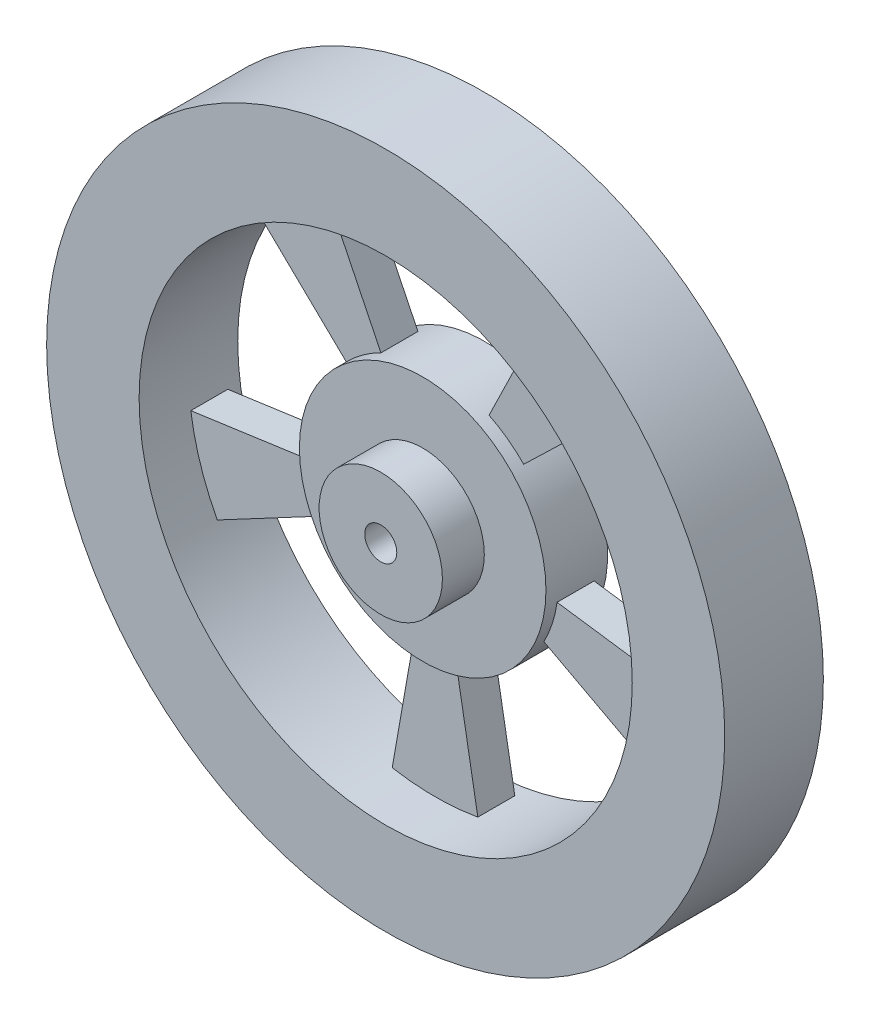
ISO-10303-21;
HEADER;
FILE_DESCRIPTION(('STEP AP214'),'2;1');
FILE_NAME('part.step','',(''),(''),'','','');
FILE_SCHEMA(('AUTOMOTIVE_DESIGN { 1 0 10303 214 1 1 1 1 }'));
ENDSEC;
DATA;
#1=APPLICATION_CONTEXT('core data for automotive mechanical design processes');
#2=APPLICATION_PROTOCOL_DEFINITION('international standard','automotive_design',2000,#1);
#3=PRODUCT_CONTEXT('',#1,'mechanical');
#4=PRODUCT('Part','Part','',(#3));
#5=PRODUCT_RELATED_PRODUCT_CATEGORY('part','',(#4));
#6=PRODUCT_DEFINITION_FORMATION('','',#4);
#7=PRODUCT_DEFINITION_CONTEXT('part definition',#1,'design');
#8=PRODUCT_DEFINITION('design','',#6,#7);
#9=PRODUCT_DEFINITION_SHAPE('','',#8);
#10=(LENGTH_UNIT() NAMED_UNIT(*) SI_UNIT(.MILLI.,.METRE.));
#11=(NAMED_UNIT(*) PLANE_ANGLE_UNIT() SI_UNIT($,.RADIAN.));
#12=(NAMED_UNIT(*) SI_UNIT($,.STERADIAN.) SOLID_ANGLE_UNIT());
#13=UNCERTAINTY_MEASURE_WITH_UNIT(LENGTH_MEASURE(1.E-05),#10,'distance_accuracy_value','');
#14=(GEOMETRIC_REPRESENTATION_CONTEXT(3) GLOBAL_UNCERTAINTY_ASSIGNED_CONTEXT((#13)) GLOBAL_UNIT_ASSIGNED_CONTEXT((#10,
#11,#12)) REPRESENTATION_CONTEXT('',''));
#15=CARTESIAN_POINT('',(0.,0.,0.));
#16=DIRECTION('',(0.,0.,1.));
#17=DIRECTION('',(1.,0.,0.));
#18=AXIS2_PLACEMENT_3D('',#15,#16,#17);
#19=CARTESIAN_POINT('',(0.,0.,5.08));
#20=DIRECTION('',(0.,0.,-1.));
#21=DIRECTION('',(-1.,0.,0.));
#22=AXIS2_PLACEMENT_3D('',#19,#20,#21);
#23=CYLINDRICAL_SURFACE('',#22,6.35);
#24=CARTESIAN_POINT('',(0.,0.,0.635));
#25=DIRECTION('',(0.,0.,-1.));
#26=DIRECTION('',(-1.,0.,0.));
#27=AXIS2_PLACEMENT_3D('',#24,#25,#26);
#28=CIRCLE('',#27,6.35);
#29=CARTESIAN_POINT('',(-4.56780773215048,4.41108065241459,0.635));
#30=VERTEX_POINT('',#29);
#31=CARTESIAN_POINT('',(-2.78365678211073,5.70734219399967,0.635));
#32=VERTEX_POINT('',#31);
#33=EDGE_CURVE('E170',#30,#32,#28,.T.);
#34=ORIENTED_EDGE('',*,*,#33,.T.);
#35=DIRECTION('',(0.,0.,-1.));
#36=VECTOR('',#35,1.);
#37=CARTESIAN_POINT('',(-2.78365678211073,5.70734219399967,5.08));
#38=LINE('',#37,#36);
#39=CARTESIAN_POINT('',(-2.78365678211073,5.70734219399967,2.54));
#40=VERTEX_POINT('',#39);
#41=EDGE_CURVE('E198',#40,#32,#38,.T.);
#42=ORIENTED_EDGE('',*,*,#41,.F.);
#43=CARTESIAN_POINT('',(0.,0.,2.54));
#44=DIRECTION('',(0.,0.,1.));
#45=DIRECTION('',(1.,0.,0.));
#46=AXIS2_PLACEMENT_3D('',#43,#44,#45);
#47=CIRCLE('',#46,6.35);
#48=CARTESIAN_POINT('',(-4.56780773215047,4.41108065241459,2.54));
#49=VERTEX_POINT('',#48);
#50=EDGE_CURVE('E196',#40,#49,#47,.T.);
#51=ORIENTED_EDGE('',*,*,#50,.T.);
#52=DIRECTION('',(0.,0.,-1.));
#53=VECTOR('',#52,1.);
#54=CARTESIAN_POINT('',(-4.56780773215047,4.41108065241459,5.08));
#55=LINE('',#54,#53);
#56=EDGE_CURVE('E190',#49,#30,#55,.T.);
#57=ORIENTED_EDGE('',*,*,#56,.T.);
#58=EDGE_LOOP('',(#34,#42,#51,#57));
#59=FACE_BOUND('',#58,.T.);
#60=CARTESIAN_POINT('',(2.78365678211061,5.70734219399973,0.635));
#61=VERTEX_POINT('',#60);
#62=CARTESIAN_POINT('',(4.56780773215038,4.41108065241469,0.635));
#63=VERTEX_POINT('',#62);
#64=EDGE_CURVE('E182',#61,#63,#28,.T.);
#65=ORIENTED_EDGE('',*,*,#64,.T.);
#66=DIRECTION('',(0.,0.,-1.));
#67=VECTOR('',#66,1.);
#68=CARTESIAN_POINT('',(4.56780773215038,4.41108065241469,5.08));
#69=LINE('',#68,#67);
#70=CARTESIAN_POINT('',(4.56780773215038,4.41108065241469,2.54));
#71=VERTEX_POINT('',#70);
#72=EDGE_CURVE('E216',#71,#63,#69,.T.);
#73=ORIENTED_EDGE('',*,*,#72,.F.);
#74=CARTESIAN_POINT('',(2.78365678211061,5.70734219399973,2.54));
#75=VERTEX_POINT('',#74);
#76=EDGE_CURVE('E617',#71,#75,#47,.T.);
#77=ORIENTED_EDGE('',*,*,#76,.T.);
#78=DIRECTION('',(0.,0.,-1.));
#79=VECTOR('',#78,1.);
#80=CARTESIAN_POINT('',(2.78365678211061,5.70734219399973,5.08));
#81=LINE('',#80,#79);
#82=EDGE_CURVE('E213',#75,#61,#81,.T.);
#83=ORIENTED_EDGE('',*,*,#82,.T.);
#84=EDGE_LOOP('',(#65,#73,#77,#83));
#85=FACE_BOUND('',#84,.T.);
#86=CARTESIAN_POINT('',(6.28820223650898,-0.883749191096396,0.635));
#87=VERTEX_POINT('',#86);
#88=CARTESIAN_POINT('',(5.60671721465422,-2.98114442369036,0.635));
#89=VERTEX_POINT('',#88);
#90=EDGE_CURVE('E679',#87,#89,#28,.T.);
#91=ORIENTED_EDGE('',*,*,#90,.T.);
#92=DIRECTION('',(0.,0.,-1.));
#93=VECTOR('',#92,1.);
#94=CARTESIAN_POINT('',(5.60671721465422,-2.98114442369036,5.08));
#95=LINE('',#94,#93);
#96=CARTESIAN_POINT('',(5.60671721465422,-2.98114442369036,2.54));
#97=VERTEX_POINT('',#96);
#98=EDGE_CURVE('E224',#97,#89,#95,.T.);
#99=ORIENTED_EDGE('',*,*,#98,.F.);
#100=CARTESIAN_POINT('',(6.28820223650898,-0.883749191096397,2.54));
#101=VERTEX_POINT('',#100);
#102=EDGE_CURVE('E56',#97,#101,#47,.T.);
#103=ORIENTED_EDGE('',*,*,#102,.T.);
#104=DIRECTION('',(0.,0.,-1.));
#105=VECTOR('',#104,1.);
#106=CARTESIAN_POINT('',(6.28820223650898,-0.883749191096397,5.08));
#107=LINE('',#106,#105);
#108=EDGE_CURVE('E222',#101,#87,#107,.T.);
#109=ORIENTED_EDGE('',*,*,#108,.T.);
#110=EDGE_LOOP('',(#91,#99,#103,#109));
#111=FACE_BOUND('',#110,.T.);
#112=DIRECTION('',(0.,0.,-1.));
#113=VECTOR('',#112,1.);
#114=CARTESIAN_POINT('',(-5.60671721465415,-2.98114442369047,5.08));
#115=LINE('',#114,#113);
#116=CARTESIAN_POINT('',(-5.60671721465415,-2.98114442369047,2.54));
#117=VERTEX_POINT('',#116);
#118=CARTESIAN_POINT('',(-5.60671721465415,-2.98114442369047,0.635));
#119=VERTEX_POINT('',#118);
#120=EDGE_CURVE('E260',#117,#119,#115,.T.);
#121=ORIENTED_EDGE('',*,*,#120,.T.);
#122=CARTESIAN_POINT('',(-6.28820223650896,-0.883749191096527,0.635));
#123=VERTEX_POINT('',#122);
#124=EDGE_CURVE('E184',#119,#123,#28,.T.);
#125=ORIENTED_EDGE('',*,*,#124,.T.);
#126=DIRECTION('',(0.,0.,-1.));
#127=VECTOR('',#126,1.);
#128=CARTESIAN_POINT('',(-6.28820223650896,-0.883749191096527,5.08));
#129=LINE('',#128,#127);
#130=CARTESIAN_POINT('',(-6.28820223650896,-0.883749191096527,2.54));
#131=VERTEX_POINT('',#130);
#132=EDGE_CURVE('E210',#131,#123,#129,.T.);
#133=ORIENTED_EDGE('',*,*,#132,.F.);
#134=EDGE_CURVE('E672',#131,#117,#47,.T.);
#135=ORIENTED_EDGE('',*,*,#134,.T.);
#136=EDGE_LOOP('',(#121,#125,#133,#135));
#137=FACE_BOUND('',#136,.T.);
#138=CARTESIAN_POINT('',(1.10266592818501,-6.25352923162752,0.635));
#139=VERTEX_POINT('',#138);
#140=CARTESIAN_POINT('',(-1.10266592818497,-6.25352923162753,0.635));
#141=VERTEX_POINT('',#140);
#142=EDGE_CURVE('E678',#139,#141,#28,.T.);
#143=ORIENTED_EDGE('',*,*,#142,.T.);
#144=DIRECTION('',(0.,0.,-1.));
#145=VECTOR('',#144,1.);
#146=CARTESIAN_POINT('',(-1.10266592818497,-6.25352923162753,5.08));
#147=LINE('',#146,#145);
#148=CARTESIAN_POINT('',(-1.10266592818497,-6.25352923162753,2.54));
#149=VERTEX_POINT('',#148);
#150=EDGE_CURVE('E257',#149,#141,#147,.T.);
#151=ORIENTED_EDGE('',*,*,#150,.F.);
#152=CARTESIAN_POINT('',(1.10266592818501,-6.25352923162752,2.54));
#153=VERTEX_POINT('',#152);
#154=EDGE_CURVE('E48',#149,#153,#47,.T.);
#155=ORIENTED_EDGE('',*,*,#154,.T.);
#156=DIRECTION('',(0.,0.,-1.));
#157=VECTOR('',#156,1.);
#158=CARTESIAN_POINT('',(1.10266592818501,-6.25352923162752,5.08));
#159=LINE('',#158,#157);
#160=EDGE_CURVE('E233',#153,#139,#159,.T.);
#161=ORIENTED_EDGE('',*,*,#160,.T.);
#162=EDGE_LOOP('',(#143,#151,#155,#161));
#163=FACE_BOUND('',#162,.T.);
#164=CARTESIAN_POINT('',(0.,0.,0.));
#165=DIRECTION('',(0.,0.,1.));
#166=DIRECTION('',(-1.,0.,0.));
#167=AXIS2_PLACEMENT_3D('',#164,#165,#166);
#168=CIRCLE('',#167,6.35);
#169=CARTESIAN_POINT('',(-6.35,0.,0.));
#170=VERTEX_POINT('',#169);
#171=EDGE_CURVE('E248',#170,#170,#168,.T.);
#172=ORIENTED_EDGE('',*,*,#171,.T.);
#173=EDGE_LOOP('',(#172));
#174=FACE_BOUND('',#173,.T.);
#175=CARTESIAN_POINT('',(0.,0.,3.175));
#176=DIRECTION('',(0.,0.,1.));
#177=DIRECTION('',(1.,0.,0.));
#178=AXIS2_PLACEMENT_3D('',#175,#176,#177);
#179=CIRCLE('',#178,6.35);
#180=CARTESIAN_POINT('',(6.35,0.,3.175));
#181=VERTEX_POINT('',#180);
#182=EDGE_CURVE('E650',#181,#181,#179,.T.);
#183=ORIENTED_EDGE('',*,*,#182,.F.);
#184=EDGE_LOOP('',(#183));
#185=FACE_BOUND('',#184,.T.);
#186=ADVANCED_FACE('F33',(#59,#85,#111,#137,#163,#174,#185),#23,.T.);
#187=CARTESIAN_POINT('',(-2.20533185636994,-12.5070584632551,5.08));
#188=DIRECTION('',(0.984807753012209,-0.173648177666924,0.));
#189=DIRECTION('',(0.173648177666924,0.984807753012209,0.));
#190=AXIS2_PLACEMENT_3D('',#187,#188,#189);
#191=PLANE('',#190);
#192=DIRECTION('',(0.173648177666924,0.984807753012209,0.));
#193=VECTOR('',#192,1.);
#194=CARTESIAN_POINT('',(-2.20533185636994,-12.5070584632551,0.635));
#195=LINE('',#194,#193);
#196=CARTESIAN_POINT('',(-2.20533185636994,-12.5070584632551,0.635));
#197=VERTEX_POINT('',#196);
#198=EDGE_CURVE('E669',#197,#141,#195,.T.);
#199=ORIENTED_EDGE('',*,*,#198,.F.);
#200=DIRECTION('',(0.,0.,-1.));
#201=VECTOR('',#200,1.);
#202=CARTESIAN_POINT('',(-2.20533185636994,-12.5070584632551,5.08));
#203=LINE('',#202,#201);
#204=CARTESIAN_POINT('',(-2.20533185636994,-12.5070584632551,2.54));
#205=VERTEX_POINT('',#204);
#206=EDGE_CURVE('E253',#205,#197,#203,.T.);
#207=ORIENTED_EDGE('',*,*,#206,.F.);
#208=DIRECTION('',(-0.173648177666924,-0.984807753012209,0.));
#209=VECTOR('',#208,1.);
#210=CARTESIAN_POINT('',(-2.20533185636994,-12.5070584632551,2.54));
#211=LINE('',#210,#209);
#212=EDGE_CURVE('E635',#149,#205,#211,.T.);
#213=ORIENTED_EDGE('',*,*,#212,.F.);
#214=ORIENTED_EDGE('',*,*,#150,.T.);
#215=EDGE_LOOP('',(#199,#207,#213,#214));
#216=FACE_BOUND('',#215,.T.);
#217=ADVANCED_FACE('F290',(#216),#191,.F.);
#218=CARTESIAN_POINT('',(-5.60671721465415,-2.98114442369047,5.08));
#219=DIRECTION('',(-0.469471562785901,0.882947592858921,0.));
#220=DIRECTION('',(-0.882947592858922,-0.469471562785901,0.));
#221=AXIS2_PLACEMENT_3D('',#218,#219,#220);
#222=PLANE('',#221);
#223=DIRECTION('',(-0.882947592858922,-0.469471562785901,0.));
#224=VECTOR('',#223,1.);
#225=CARTESIAN_POINT('',(-5.60671721465415,-2.98114442369047,0.635));
#226=LINE('',#225,#224);
#227=CARTESIAN_POINT('',(-11.2134344293083,-5.96228884738094,0.635));
#228=VERTEX_POINT('',#227);
#229=EDGE_CURVE('E668',#119,#228,#226,.T.);
#230=ORIENTED_EDGE('',*,*,#229,.F.);
#231=ORIENTED_EDGE('',*,*,#120,.F.);
#232=DIRECTION('',(0.882947592858922,0.469471562785901,0.));
#233=VECTOR('',#232,1.);
#234=CARTESIAN_POINT('',(-5.60671721465415,-2.98114442369047,2.54));
#235=LINE('',#234,#233);
#236=CARTESIAN_POINT('',(-11.2134344293083,-5.96228884738094,2.54));
#237=VERTEX_POINT('',#236);
#238=EDGE_CURVE('E633',#237,#117,#235,.T.);
#239=ORIENTED_EDGE('',*,*,#238,.F.);
#240=DIRECTION('',(0.,0.,-1.));
#241=VECTOR('',#240,1.);
#242=CARTESIAN_POINT('',(-11.2134344293083,-5.96228884738094,5.08));
#243=LINE('',#242,#241);
#244=EDGE_CURVE('E247',#237,#228,#243,.T.);
#245=ORIENTED_EDGE('',*,*,#244,.T.);
#246=EDGE_LOOP('',(#230,#231,#239,#245));
#247=FACE_BOUND('',#246,.T.);
#248=ADVANCED_FACE('F295',(#247),#222,.F.);
#249=CARTESIAN_POINT('',(1.10266592818501,-6.25352923162752,5.08));
#250=DIRECTION('',(-0.984807753012208,-0.173648177666931,0.));
#251=DIRECTION('',(0.173648177666931,-0.984807753012208,0.));
#252=AXIS2_PLACEMENT_3D('',#249,#250,#251);
#253=PLANE('',#252);
#254=DIRECTION('',(0.173648177666931,-0.984807753012208,0.));
#255=VECTOR('',#254,1.);
#256=CARTESIAN_POINT('',(1.10266592818501,-6.25352923162752,0.635));
#257=LINE('',#256,#255);
#258=CARTESIAN_POINT('',(2.20533185637002,-12.507058463255,0.635));
#259=VERTEX_POINT('',#258);
#260=EDGE_CURVE('E666',#139,#259,#257,.T.);
#261=ORIENTED_EDGE('',*,*,#260,.F.);
#262=ORIENTED_EDGE('',*,*,#160,.F.);
#263=DIRECTION('',(-0.173648177666931,0.984807753012208,0.));
#264=VECTOR('',#263,1.);
#265=CARTESIAN_POINT('',(1.10266592818501,-6.25352923162752,2.54));
#266=LINE('',#265,#264);
#267=CARTESIAN_POINT('',(2.20533185637002,-12.507058463255,2.54));
#268=VERTEX_POINT('',#267);
#269=EDGE_CURVE('E631',#268,#153,#266,.T.);
#270=ORIENTED_EDGE('',*,*,#269,.F.);
#271=DIRECTION('',(0.,0.,-1.));
#272=VECTOR('',#271,1.);
#273=CARTESIAN_POINT('',(2.20533185637002,-12.507058463255,5.08));
#274=LINE('',#273,#272);
#275=EDGE_CURVE('E236',#268,#259,#274,.T.);
#276=ORIENTED_EDGE('',*,*,#275,.T.);
#277=EDGE_LOOP('',(#261,#262,#270,#276));
#278=FACE_BOUND('',#277,.T.);
#279=ADVANCED_FACE('F301',(#278),#253,.F.);
#280=CARTESIAN_POINT('',(11.2134344293084,-5.96228884738071,5.08));
#281=DIRECTION('',(0.469471562785883,0.882947592858931,0.));
#282=DIRECTION('',(-0.882947592858931,0.469471562785883,0.));
#283=AXIS2_PLACEMENT_3D('',#280,#281,#282);
#284=PLANE('',#283);
#285=DIRECTION('',(-0.882947592858931,0.469471562785883,0.));
#286=VECTOR('',#285,1.);
#287=CARTESIAN_POINT('',(11.2134344293084,-5.96228884738071,0.635));
#288=LINE('',#287,#286);
#289=CARTESIAN_POINT('',(11.2134344293084,-5.96228884738071,0.635));
#290=VERTEX_POINT('',#289);
#291=EDGE_CURVE('E664',#290,#89,#288,.T.);
#292=ORIENTED_EDGE('',*,*,#291,.F.);
#293=DIRECTION('',(0.,0.,-1.));
#294=VECTOR('',#293,1.);
#295=CARTESIAN_POINT('',(11.2134344293084,-5.96228884738071,5.08));
#296=LINE('',#295,#294);
#297=CARTESIAN_POINT('',(11.2134344293084,-5.96228884738071,2.54));
#298=VERTEX_POINT('',#297);
#299=EDGE_CURVE('E239',#298,#290,#296,.T.);
#300=ORIENTED_EDGE('',*,*,#299,.F.);
#301=DIRECTION('',(0.882947592858931,-0.469471562785883,0.));
#302=VECTOR('',#301,1.);
#303=CARTESIAN_POINT('',(11.2134344293084,-5.96228884738071,2.54));
#304=LINE('',#303,#302);
#305=EDGE_CURVE('E629',#97,#298,#304,.T.);
#306=ORIENTED_EDGE('',*,*,#305,.F.);
#307=ORIENTED_EDGE('',*,*,#98,.T.);
#308=EDGE_LOOP('',(#292,#300,#306,#307));
#309=FACE_BOUND('',#308,.T.);
#310=ADVANCED_FACE('F491',(#309),#284,.F.);
#311=CARTESIAN_POINT('',(6.28820223650898,-0.883749191096397,5.08));
#312=DIRECTION('',(-0.139173100960062,-0.990268068741571,0.));
#313=DIRECTION('',(0.990268068741571,-0.139173100960062,0.));
#314=AXIS2_PLACEMENT_3D('',#311,#312,#313);
#315=PLANE('',#314);
#316=DIRECTION('',(0.990268068741571,-0.139173100960062,0.));
#317=VECTOR('',#316,1.);
#318=CARTESIAN_POINT('',(6.28820223650898,-0.883749191096397,0.635));
#319=LINE('',#318,#317);
#320=CARTESIAN_POINT('',(12.5764044730179,-1.76749838219279,0.635));
#321=VERTEX_POINT('',#320);
#322=EDGE_CURVE('E662',#87,#321,#319,.T.);
#323=ORIENTED_EDGE('',*,*,#322,.F.);
#324=ORIENTED_EDGE('',*,*,#108,.F.);
#325=DIRECTION('',(-0.990268068741571,0.139173100960062,0.));
#326=VECTOR('',#325,1.);
#327=CARTESIAN_POINT('',(6.28820223650898,-0.883749191096397,2.54));
#328=LINE('',#327,#326);
#329=CARTESIAN_POINT('',(12.576404473018,-1.76749838219279,2.54));
#330=VERTEX_POINT('',#329);
#331=EDGE_CURVE('E627',#330,#101,#328,.T.);
#332=ORIENTED_EDGE('',*,*,#331,.F.);
#333=DIRECTION('',(0.,0.,-1.));
#334=VECTOR('',#333,1.);
#335=CARTESIAN_POINT('',(12.576404473018,-1.76749838219279,5.08));
#336=LINE('',#335,#334);
#337=EDGE_CURVE('E225',#330,#321,#336,.T.);
#338=ORIENTED_EDGE('',*,*,#337,.T.);
#339=EDGE_LOOP('',(#323,#324,#332,#338));
#340=FACE_BOUND('',#339,.T.);
#341=ADVANCED_FACE('F500',(#340),#315,.F.);
#342=CARTESIAN_POINT('',(9.13561546430076,8.82216130482938,5.08));
#343=DIRECTION('',(-0.694658370459006,0.719339800338643,0.));
#344=DIRECTION('',(-0.719339800338643,-0.694658370459006,0.));
#345=AXIS2_PLACEMENT_3D('',#342,#343,#344);
#346=PLANE('',#345);
#347=DIRECTION('',(-0.719339800338643,-0.694658370459006,0.));
#348=VECTOR('',#347,1.);
#349=CARTESIAN_POINT('',(9.13561546430076,8.82216130482938,0.635));
#350=LINE('',#349,#348);
#351=CARTESIAN_POINT('',(9.13561546430076,8.82216130482938,0.635));
#352=VERTEX_POINT('',#351);
#353=EDGE_CURVE('E660',#352,#63,#350,.T.);
#354=ORIENTED_EDGE('',*,*,#353,.F.);
#355=DIRECTION('',(0.,0.,-1.));
#356=VECTOR('',#355,1.);
#357=CARTESIAN_POINT('',(9.13561546430076,8.82216130482938,5.08));
#358=LINE('',#357,#356);
#359=CARTESIAN_POINT('',(9.13561546430076,8.82216130482938,2.54));
#360=VERTEX_POINT('',#359);
#361=EDGE_CURVE('E228',#360,#352,#358,.T.);
#362=ORIENTED_EDGE('',*,*,#361,.F.);
#363=DIRECTION('',(0.719339800338643,0.694658370459006,0.));
#364=VECTOR('',#363,1.);
#365=CARTESIAN_POINT('',(9.13561546430076,8.82216130482938,2.54));
#366=LINE('',#365,#364);
#367=EDGE_CURVE('E625',#71,#360,#366,.T.);
#368=ORIENTED_EDGE('',*,*,#367,.F.);
#369=ORIENTED_EDGE('',*,*,#72,.T.);
#370=EDGE_LOOP('',(#354,#362,#368,#369));
#371=FACE_BOUND('',#370,.T.);
#372=ADVANCED_FACE('F508',(#371),#346,.F.);
#373=CARTESIAN_POINT('',(2.78365678211061,5.70734219399973,5.08));
#374=DIRECTION('',(0.89879404629917,-0.438371146789072,0.));
#375=DIRECTION('',(0.438371146789072,0.89879404629917,0.));
#376=AXIS2_PLACEMENT_3D('',#373,#374,#375);
#377=PLANE('',#376);
#378=DIRECTION('',(0.438371146789072,0.89879404629917,0.));
#379=VECTOR('',#378,1.);
#380=CARTESIAN_POINT('',(2.78365678211061,5.70734219399973,0.635));
#381=LINE('',#380,#379);
#382=CARTESIAN_POINT('',(5.56731356422122,11.4146843879995,0.635));
#383=VERTEX_POINT('',#382);
#384=EDGE_CURVE('E658',#61,#383,#381,.T.);
#385=ORIENTED_EDGE('',*,*,#384,.F.);
#386=ORIENTED_EDGE('',*,*,#82,.F.);
#387=DIRECTION('',(-0.438371146789072,-0.89879404629917,0.));
#388=VECTOR('',#387,1.);
#389=CARTESIAN_POINT('',(2.78365678211061,5.70734219399973,2.54));
#390=LINE('',#389,#388);
#391=CARTESIAN_POINT('',(5.56731356422122,11.4146843879995,2.54));
#392=VERTEX_POINT('',#391);
#393=EDGE_CURVE('E622',#392,#75,#390,.T.);
#394=ORIENTED_EDGE('',*,*,#393,.F.);
#395=DIRECTION('',(0.,0.,-1.));
#396=VECTOR('',#395,1.);
#397=CARTESIAN_POINT('',(5.56731356422122,11.4146843879995,5.08));
#398=LINE('',#397,#396);
#399=EDGE_CURVE('E217',#392,#383,#398,.T.);
#400=ORIENTED_EDGE('',*,*,#399,.T.);
#401=EDGE_LOOP('',(#385,#386,#394,#400));
#402=FACE_BOUND('',#401,.T.);
#403=ADVANCED_FACE('F517',(#402),#377,.F.);
#404=CARTESIAN_POINT('',(-5.56731356422145,11.4146843879993,5.08));
#405=DIRECTION('',(-0.89879404629916,-0.438371146789091,0.));
#406=DIRECTION('',(0.438371146789091,-0.89879404629916,0.));
#407=AXIS2_PLACEMENT_3D('',#404,#405,#406);
#408=PLANE('',#407);
#409=DIRECTION('',(0.438371146789091,-0.89879404629916,0.));
#410=VECTOR('',#409,1.);
#411=CARTESIAN_POINT('',(-5.56731356422145,11.4146843879993,0.635));
#412=LINE('',#411,#410);
#413=CARTESIAN_POINT('',(-5.56731356422146,11.4146843879993,0.635));
#414=VERTEX_POINT('',#413);
#415=EDGE_CURVE('E176',#414,#32,#412,.T.);
#416=ORIENTED_EDGE('',*,*,#415,.F.);
#417=DIRECTION('',(0.,0.,-1.));
#418=VECTOR('',#417,1.);
#419=CARTESIAN_POINT('',(-5.56731356422146,11.4146843879993,5.08));
#420=LINE('',#419,#418);
#421=CARTESIAN_POINT('',(-5.56731356422145,11.4146843879993,2.54));
#422=VERTEX_POINT('',#421);
#423=EDGE_CURVE('E200',#422,#414,#420,.T.);
#424=ORIENTED_EDGE('',*,*,#423,.F.);
#425=DIRECTION('',(-0.438371146789091,0.89879404629916,0.));
#426=VECTOR('',#425,1.);
#427=CARTESIAN_POINT('',(-5.56731356422145,11.4146843879993,2.54));
#428=LINE('',#427,#426);
#429=EDGE_CURVE('E620',#40,#422,#428,.T.);
#430=ORIENTED_EDGE('',*,*,#429,.F.);
#431=ORIENTED_EDGE('',*,*,#41,.T.);
#432=EDGE_LOOP('',(#416,#424,#430,#431));
#433=FACE_BOUND('',#432,.T.);
#434=ADVANCED_FACE('F526',(#433),#408,.F.);
#435=CARTESIAN_POINT('',(-4.56780773215047,4.41108065241459,5.08));
#436=DIRECTION('',(0.694658370458991,0.719339800338657,0.));
#437=DIRECTION('',(-0.719339800338657,0.694658370458991,0.));
#438=AXIS2_PLACEMENT_3D('',#435,#436,#437);
#439=PLANE('',#438);
#440=DIRECTION('',(-0.719339800338657,0.694658370458991,0.));
#441=VECTOR('',#440,1.);
#442=CARTESIAN_POINT('',(-4.56780773215047,4.41108065241459,0.635));
#443=LINE('',#442,#441);
#444=CARTESIAN_POINT('',(-9.13561546430095,8.82216130482919,0.635));
#445=VERTEX_POINT('',#444);
#446=EDGE_CURVE('E173',#30,#445,#443,.T.);
#447=ORIENTED_EDGE('',*,*,#446,.F.);
#448=ORIENTED_EDGE('',*,*,#56,.F.);
#449=DIRECTION('',(0.719339800338657,-0.694658370458991,0.));
#450=VECTOR('',#449,1.);
#451=CARTESIAN_POINT('',(-4.56780773215047,4.41108065241459,2.54));
#452=LINE('',#451,#450);
#453=CARTESIAN_POINT('',(-9.13561546430095,8.82216130482919,2.54));
#454=VERTEX_POINT('',#453);
#455=EDGE_CURVE('E616',#454,#49,#452,.T.);
#456=ORIENTED_EDGE('',*,*,#455,.F.);
#457=DIRECTION('',(0.,0.,-1.));
#458=VECTOR('',#457,1.);
#459=CARTESIAN_POINT('',(-9.13561546430095,8.82216130482919,5.08));
#460=LINE('',#459,#458);
#461=EDGE_CURVE('E192',#454,#445,#460,.T.);
#462=ORIENTED_EDGE('',*,*,#461,.T.);
#463=EDGE_LOOP('',(#447,#448,#456,#462));
#464=FACE_BOUND('',#463,.T.);
#465=ADVANCED_FACE('F188',(#464),#439,.F.);
#466=CARTESIAN_POINT('',(-12.5764044730179,-1.76749838219305,5.08));
#467=DIRECTION('',(0.139173100960083,-0.990268068741568,0.));
#468=DIRECTION('',(0.990268068741568,0.139173100960083,0.));
#469=AXIS2_PLACEMENT_3D('',#466,#467,#468);
#470=PLANE('',#469);
#471=DIRECTION('',(0.990268068741568,0.139173100960083,0.));
#472=VECTOR('',#471,1.);
#473=CARTESIAN_POINT('',(-12.5764044730179,-1.76749838219305,0.635));
#474=LINE('',#473,#472);
#475=CARTESIAN_POINT('',(-12.5764044730179,-1.76749838219306,0.635));
#476=VERTEX_POINT('',#475);
#477=EDGE_CURVE('E193',#476,#123,#474,.T.);
#478=ORIENTED_EDGE('',*,*,#477,.F.);
#479=DIRECTION('',(0.,0.,-1.));
#480=VECTOR('',#479,1.);
#481=CARTESIAN_POINT('',(-12.5764044730179,-1.76749838219306,5.08));
#482=LINE('',#481,#480);
#483=CARTESIAN_POINT('',(-12.5764044730179,-1.76749838219305,2.54));
#484=VERTEX_POINT('',#483);
#485=EDGE_CURVE('E202',#484,#476,#482,.T.);
#486=ORIENTED_EDGE('',*,*,#485,.F.);
#487=DIRECTION('',(-0.990268068741568,-0.139173100960083,0.));
#488=VECTOR('',#487,1.);
#489=CARTESIAN_POINT('',(-12.5764044730179,-1.76749838219305,2.54));
#490=LINE('',#489,#488);
#491=EDGE_CURVE('E11',#131,#484,#490,.T.);
#492=ORIENTED_EDGE('',*,*,#491,.F.);
#493=ORIENTED_EDGE('',*,*,#132,.T.);
#494=EDGE_LOOP('',(#478,#486,#492,#493));
#495=FACE_BOUND('',#494,.T.);
#496=ADVANCED_FACE('F287',(#495),#470,.F.);
#497=CARTESIAN_POINT('',(0.,0.,0.));
#498=DIRECTION('',(0.,0.,1.));
#499=DIRECTION('',(1.,0.,0.));
#500=AXIS2_PLACEMENT_3D('',#497,#498,#499);
#501=PLANE('',#500);
#502=CARTESIAN_POINT('',(0.,0.,0.));
#503=DIRECTION('',(0.,0.,1.));
#504=DIRECTION('',(1.,0.,0.));
#505=AXIS2_PLACEMENT_3D('',#502,#503,#504);
#506=CIRCLE('',#505,0.8255);
#507=CARTESIAN_POINT('',(0.8255,0.,0.));
#508=VERTEX_POINT('',#507);
#509=EDGE_CURVE('E638',#508,#508,#506,.T.);
#510=ORIENTED_EDGE('',*,*,#509,.T.);
#511=EDGE_LOOP('',(#510));
#512=FACE_BOUND('',#511,.T.);
#513=ORIENTED_EDGE('',*,*,#171,.F.);
#514=EDGE_LOOP('',(#513));
#515=FACE_BOUND('',#514,.T.);
#516=ADVANCED_FACE('F274',(#512,#515),#501,.F.);
#517=CARTESIAN_POINT('',(0.,0.,5.08));
#518=DIRECTION('',(0.,0.,1.));
#519=DIRECTION('',(1.,0.,0.));
#520=AXIS2_PLACEMENT_3D('',#517,#518,#519);
#521=PLANE('',#520);
#522=CARTESIAN_POINT('',(0.,0.,5.08));
#523=DIRECTION('',(0.,0.,-1.));
#524=DIRECTION('',(-1.,0.,0.));
#525=AXIS2_PLACEMENT_3D('',#522,#523,#524);
#526=CIRCLE('',#525,12.7);
#527=CARTESIAN_POINT('',(-12.7,0.,5.08));
#528=VERTEX_POINT('',#527);
#529=EDGE_CURVE('E244',#528,#528,#526,.T.);
#530=ORIENTED_EDGE('',*,*,#529,.T.);
#531=EDGE_LOOP('',(#530));
#532=FACE_BOUND('',#531,.T.);
#533=CARTESIAN_POINT('',(0.,0.,5.08));
#534=DIRECTION('',(0.,0.,1.));
#535=DIRECTION('',(1.,0.,0.));
#536=AXIS2_PLACEMENT_3D('',#533,#534,#535);
#537=CIRCLE('',#536,17.4625);
#538=CARTESIAN_POINT('',(17.4625,0.,5.08));
#539=VERTEX_POINT('',#538);
#540=EDGE_CURVE('E41',#539,#539,#537,.T.);
#541=ORIENTED_EDGE('',*,*,#540,.T.);
#542=EDGE_LOOP('',(#541));
#543=FACE_BOUND('',#542,.T.);
#544=ADVANCED_FACE('F282',(#532,#543),#521,.T.);
#545=CARTESIAN_POINT('',(0.,0.,5.08));
#546=DIRECTION('',(0.,0.,-1.));
#547=DIRECTION('',(-1.,0.,0.));
#548=AXIS2_PLACEMENT_3D('',#545,#546,#547);
#549=CYLINDRICAL_SURFACE('',#548,17.4625);
#550=ORIENTED_EDGE('',*,*,#540,.F.);
#551=EDGE_LOOP('',(#550));
#552=FACE_BOUND('',#551,.T.);
#553=CARTESIAN_POINT('',(0.,0.,0.));
#554=DIRECTION('',(0.,0.,1.));
#555=DIRECTION('',(1.,0.,0.));
#556=AXIS2_PLACEMENT_3D('',#553,#554,#555);
#557=CIRCLE('',#556,17.4625);
#558=CARTESIAN_POINT('',(17.4625,0.,0.));
#559=VERTEX_POINT('',#558);
#560=EDGE_CURVE('E256',#559,#559,#557,.T.);
#561=ORIENTED_EDGE('',*,*,#560,.T.);
#562=EDGE_LOOP('',(#561));
#563=FACE_BOUND('',#562,.T.);
#564=ADVANCED_FACE('F35',(#552,#563),#549,.T.);
#565=CARTESIAN_POINT('',(0.,0.,0.));
#566=DIRECTION('',(0.,0.,-1.));
#567=DIRECTION('',(-1.,0.,0.));
#568=AXIS2_PLACEMENT_3D('',#565,#566,#567);
#569=CIRCLE('',#568,12.7);
#570=CARTESIAN_POINT('',(-12.7,0.,0.));
#571=VERTEX_POINT('',#570);
#572=EDGE_CURVE('E235',#571,#571,#569,.T.);
#573=ORIENTED_EDGE('',*,*,#572,.F.);
#574=EDGE_LOOP('',(#573));
#575=FACE_BOUND('',#574,.T.);
#576=ORIENTED_EDGE('',*,*,#560,.F.);
#577=EDGE_LOOP('',(#576));
#578=FACE_BOUND('',#577,.T.);
#579=ADVANCED_FACE('F270',(#575,#578),#501,.F.);
#580=CARTESIAN_POINT('',(0.,0.,5.08));
#581=DIRECTION('',(0.,0.,-1.));
#582=DIRECTION('',(-1.,0.,0.));
#583=AXIS2_PLACEMENT_3D('',#580,#581,#582);
#584=CYLINDRICAL_SURFACE('',#583,12.7);
#585=ORIENTED_EDGE('',*,*,#572,.T.);
#586=EDGE_LOOP('',(#585));
#587=FACE_BOUND('',#586,.T.);
#588=ORIENTED_EDGE('',*,*,#206,.T.);
#589=CARTESIAN_POINT('',(0.,0.,0.635));
#590=DIRECTION('',(0.,0.,-1.));
#591=DIRECTION('',(-1.,0.,0.));
#592=AXIS2_PLACEMENT_3D('',#589,#590,#591);
#593=CIRCLE('',#592,12.7);
#594=EDGE_CURVE('E694',#259,#197,#593,.T.);
#595=ORIENTED_EDGE('',*,*,#594,.F.);
#596=ORIENTED_EDGE('',*,*,#275,.F.);
#597=CARTESIAN_POINT('',(0.,0.,2.54));
#598=DIRECTION('',(0.,0.,1.));
#599=DIRECTION('',(1.,0.,0.));
#600=AXIS2_PLACEMENT_3D('',#597,#598,#599);
#601=CIRCLE('',#600,12.7);
#602=EDGE_CURVE('E610',#205,#268,#601,.T.);
#603=ORIENTED_EDGE('',*,*,#602,.F.);
#604=EDGE_LOOP('',(#588,#595,#596,#603));
#605=FACE_BOUND('',#604,.T.);
#606=EDGE_CURVE('E181',#228,#476,#593,.T.);
#607=ORIENTED_EDGE('',*,*,#606,.F.);
#608=ORIENTED_EDGE('',*,*,#244,.F.);
#609=EDGE_CURVE('E607',#484,#237,#601,.T.);
#610=ORIENTED_EDGE('',*,*,#609,.F.);
#611=ORIENTED_EDGE('',*,*,#485,.T.);
#612=EDGE_LOOP('',(#607,#608,#610,#611));
#613=FACE_BOUND('',#612,.T.);
#614=ORIENTED_EDGE('',*,*,#299,.T.);
#615=EDGE_CURVE('E693',#321,#290,#593,.T.);
#616=ORIENTED_EDGE('',*,*,#615,.F.);
#617=ORIENTED_EDGE('',*,*,#337,.F.);
#618=EDGE_CURVE('E613',#298,#330,#601,.T.);
#619=ORIENTED_EDGE('',*,*,#618,.F.);
#620=EDGE_LOOP('',(#614,#616,#617,#619));
#621=FACE_BOUND('',#620,.T.);
#622=ORIENTED_EDGE('',*,*,#361,.T.);
#623=EDGE_CURVE('E655',#383,#352,#593,.T.);
#624=ORIENTED_EDGE('',*,*,#623,.F.);
#625=ORIENTED_EDGE('',*,*,#399,.F.);
#626=EDGE_CURVE('E612',#360,#392,#601,.T.);
#627=ORIENTED_EDGE('',*,*,#626,.F.);
#628=EDGE_LOOP('',(#622,#624,#625,#627));
#629=FACE_BOUND('',#628,.T.);
#630=ORIENTED_EDGE('',*,*,#423,.T.);
#631=EDGE_CURVE('E600',#445,#414,#593,.T.);
#632=ORIENTED_EDGE('',*,*,#631,.F.);
#633=ORIENTED_EDGE('',*,*,#461,.F.);
#634=EDGE_CURVE('E609',#422,#454,#601,.T.);
#635=ORIENTED_EDGE('',*,*,#634,.F.);
#636=EDGE_LOOP('',(#630,#632,#633,#635));
#637=FACE_BOUND('',#636,.T.);
#638=ORIENTED_EDGE('',*,*,#529,.F.);
#639=EDGE_LOOP('',(#638));
#640=FACE_BOUND('',#639,.T.);
#641=ADVANCED_FACE('F272',(#587,#605,#613,#621,#629,#637,#640),#584,.F.);
#642=CARTESIAN_POINT('',(0.,0.,5.334));
#643=DIRECTION('',(0.,0.,-1.));
#644=DIRECTION('',(-1.,0.,0.));
#645=AXIS2_PLACEMENT_3D('',#642,#643,#644);
#646=CYLINDRICAL_SURFACE('',#645,3.175);
#647=CARTESIAN_POINT('',(0.,0.,5.334));
#648=DIRECTION('',(0.,0.,1.));
#649=DIRECTION('',(1.,0.,0.));
#650=AXIS2_PLACEMENT_3D('',#647,#648,#649);
#651=CIRCLE('',#650,3.175);
#652=CARTESIAN_POINT('',(3.175,0.,5.334));
#653=VERTEX_POINT('',#652);
#654=EDGE_CURVE('E205',#653,#653,#651,.T.);
#655=ORIENTED_EDGE('',*,*,#654,.F.);
#656=EDGE_LOOP('',(#655));
#657=FACE_BOUND('',#656,.T.);
#658=CARTESIAN_POINT('',(0.,0.,3.175));
#659=DIRECTION('',(0.,0.,1.));
#660=DIRECTION('',(1.,0.,0.));
#661=AXIS2_PLACEMENT_3D('',#658,#659,#660);
#662=CIRCLE('',#661,3.175);
#663=CARTESIAN_POINT('',(3.175,0.,3.175));
#664=VERTEX_POINT('',#663);
#665=EDGE_CURVE('E649',#664,#664,#662,.T.);
#666=ORIENTED_EDGE('',*,*,#665,.T.);
#667=EDGE_LOOP('',(#666));
#668=FACE_BOUND('',#667,.T.);
#669=ADVANCED_FACE('F279',(#657,#668),#646,.T.);
#670=CARTESIAN_POINT('',(0.,0.,5.334));
#671=DIRECTION('',(0.,0.,1.));
#672=DIRECTION('',(1.,0.,0.));
#673=AXIS2_PLACEMENT_3D('',#670,#671,#672);
#674=PLANE('',#673);
#675=CARTESIAN_POINT('',(0.,0.,5.334));
#676=DIRECTION('',(0.,0.,1.));
#677=DIRECTION('',(1.,0.,0.));
#678=AXIS2_PLACEMENT_3D('',#675,#676,#677);
#679=CIRCLE('',#678,0.8255);
#680=CARTESIAN_POINT('',(0.8255,0.,5.334));
#681=VERTEX_POINT('',#680);
#682=EDGE_CURVE('E637',#681,#681,#679,.T.);
#683=ORIENTED_EDGE('',*,*,#682,.F.);
#684=EDGE_LOOP('',(#683));
#685=FACE_BOUND('',#684,.T.);
#686=ORIENTED_EDGE('',*,*,#654,.T.);
#687=EDGE_LOOP('',(#686));
#688=FACE_BOUND('',#687,.T.);
#689=ADVANCED_FACE('F326',(#685,#688),#674,.T.);
#690=CARTESIAN_POINT('',(0.,0.,0.));
#691=DIRECTION('',(0.,0.,1.));
#692=DIRECTION('',(1.,0.,0.));
#693=AXIS2_PLACEMENT_3D('',#690,#691,#692);
#694=CYLINDRICAL_SURFACE('',#693,0.8255);
#695=ORIENTED_EDGE('',*,*,#509,.F.);
#696=EDGE_LOOP('',(#695));
#697=FACE_BOUND('',#696,.T.);
#698=ORIENTED_EDGE('',*,*,#682,.T.);
#699=EDGE_LOOP('',(#698));
#700=FACE_BOUND('',#699,.T.);
#701=ADVANCED_FACE('F330',(#697,#700),#694,.F.);
#702=CARTESIAN_POINT('',(0.,0.,2.54));
#703=DIRECTION('',(0.,0.,1.));
#704=DIRECTION('',(1.,0.,0.));
#705=AXIS2_PLACEMENT_3D('',#702,#703,#704);
#706=PLANE('',#705);
#707=ORIENTED_EDGE('',*,*,#238,.T.);
#708=ORIENTED_EDGE('',*,*,#134,.F.);
#709=ORIENTED_EDGE('',*,*,#491,.T.);
#710=ORIENTED_EDGE('',*,*,#609,.T.);
#711=EDGE_LOOP('',(#707,#708,#709,#710));
#712=FACE_BOUND('',#711,.T.);
#713=ADVANCED_FACE('F341',(#712),#706,.T.);
#714=ORIENTED_EDGE('',*,*,#429,.T.);
#715=ORIENTED_EDGE('',*,*,#634,.T.);
#716=ORIENTED_EDGE('',*,*,#455,.T.);
#717=ORIENTED_EDGE('',*,*,#50,.F.);
#718=EDGE_LOOP('',(#714,#715,#716,#717));
#719=FACE_BOUND('',#718,.T.);
#720=ADVANCED_FACE('F351',(#719),#706,.T.);
#721=ORIENTED_EDGE('',*,*,#367,.T.);
#722=ORIENTED_EDGE('',*,*,#626,.T.);
#723=ORIENTED_EDGE('',*,*,#393,.T.);
#724=ORIENTED_EDGE('',*,*,#76,.F.);
#725=EDGE_LOOP('',(#721,#722,#723,#724));
#726=FACE_BOUND('',#725,.T.);
#727=ADVANCED_FACE('F361',(#726),#706,.T.);
#728=ORIENTED_EDGE('',*,*,#305,.T.);
#729=ORIENTED_EDGE('',*,*,#618,.T.);
#730=ORIENTED_EDGE('',*,*,#331,.T.);
#731=ORIENTED_EDGE('',*,*,#102,.F.);
#732=EDGE_LOOP('',(#728,#729,#730,#731));
#733=FACE_BOUND('',#732,.T.);
#734=ADVANCED_FACE('F354',(#733),#706,.T.);
#735=ORIENTED_EDGE('',*,*,#212,.T.);
#736=ORIENTED_EDGE('',*,*,#602,.T.);
#737=ORIENTED_EDGE('',*,*,#269,.T.);
#738=ORIENTED_EDGE('',*,*,#154,.F.);
#739=EDGE_LOOP('',(#735,#736,#737,#738));
#740=FACE_BOUND('',#739,.T.);
#741=ADVANCED_FACE('F355',(#740),#706,.T.);
#742=CARTESIAN_POINT('',(0.,0.,0.635));
#743=DIRECTION('',(0.,0.,-1.));
#744=DIRECTION('',(-1.,0.,0.));
#745=AXIS2_PLACEMENT_3D('',#742,#743,#744);
#746=PLANE('',#745);
#747=ORIENTED_EDGE('',*,*,#291,.T.);
#748=ORIENTED_EDGE('',*,*,#90,.F.);
#749=ORIENTED_EDGE('',*,*,#322,.T.);
#750=ORIENTED_EDGE('',*,*,#615,.T.);
#751=EDGE_LOOP('',(#747,#748,#749,#750));
#752=FACE_BOUND('',#751,.T.);
#753=ADVANCED_FACE('F380',(#752),#746,.T.);
#754=ORIENTED_EDGE('',*,*,#198,.T.);
#755=ORIENTED_EDGE('',*,*,#142,.F.);
#756=ORIENTED_EDGE('',*,*,#260,.T.);
#757=ORIENTED_EDGE('',*,*,#594,.T.);
#758=EDGE_LOOP('',(#754,#755,#756,#757));
#759=FACE_BOUND('',#758,.T.);
#760=ADVANCED_FACE('F388',(#759),#746,.T.);
#761=ORIENTED_EDGE('',*,*,#229,.T.);
#762=ORIENTED_EDGE('',*,*,#606,.T.);
#763=ORIENTED_EDGE('',*,*,#477,.T.);
#764=ORIENTED_EDGE('',*,*,#124,.F.);
#765=EDGE_LOOP('',(#761,#762,#763,#764));
#766=FACE_BOUND('',#765,.T.);
#767=ADVANCED_FACE('F392',(#766),#746,.T.);
#768=ORIENTED_EDGE('',*,*,#415,.T.);
#769=ORIENTED_EDGE('',*,*,#33,.F.);
#770=ORIENTED_EDGE('',*,*,#446,.T.);
#771=ORIENTED_EDGE('',*,*,#631,.T.);
#772=EDGE_LOOP('',(#768,#769,#770,#771));
#773=FACE_BOUND('',#772,.T.);
#774=ADVANCED_FACE('F172',(#773),#746,.T.);
#775=ORIENTED_EDGE('',*,*,#353,.T.);
#776=ORIENTED_EDGE('',*,*,#64,.F.);
#777=ORIENTED_EDGE('',*,*,#384,.T.);
#778=ORIENTED_EDGE('',*,*,#623,.T.);
#779=EDGE_LOOP('',(#775,#776,#777,#778));
#780=FACE_BOUND('',#779,.T.);
#781=ADVANCED_FACE('F391',(#780),#746,.T.);
#782=CARTESIAN_POINT('',(0.,0.,3.175));
#783=DIRECTION('',(0.,0.,1.));
#784=DIRECTION('',(1.,0.,0.));
#785=AXIS2_PLACEMENT_3D('',#782,#783,#784);
#786=PLANE('',#785);
#787=ORIENTED_EDGE('',*,*,#665,.F.);
#788=EDGE_LOOP('',(#787));
#789=FACE_BOUND('',#788,.T.);
#790=ORIENTED_EDGE('',*,*,#182,.T.);
#791=EDGE_LOOP('',(#790));
#792=FACE_BOUND('',#791,.T.);
#793=ADVANCED_FACE('F416',(#789,#792),#786,.T.);
#794=CLOSED_SHELL('',(#186,#217,#248,#279,#310,#341,#372,#403,#434,#465,#496,#516,#544,#564,
#579,#641,#669,#689,#701,#713,#720,#727,#734,#741,#753,#760,#767,#774,#781,#793));
#795=MANIFOLD_SOLID_BREP('B2',#794);
#796=ADVANCED_BREP_SHAPE_REPRESENTATION('',(#18,#795),#14);
#797=SHAPE_DEFINITION_REPRESENTATION(#9,#796);
ENDSEC;
END-ISO-10303-21;
